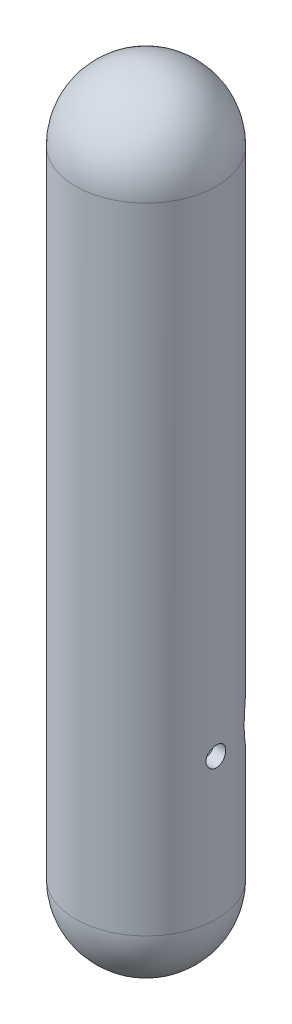
ISO-10303-21;
HEADER;
FILE_DESCRIPTION(('STEP AP214'),'2;1');
FILE_NAME('part.step','',(''),(''),'','','');
FILE_SCHEMA(('AUTOMOTIVE_DESIGN { 1 0 10303 214 1 1 1 1 }'));
ENDSEC;
DATA;
#1=APPLICATION_CONTEXT('core data for automotive mechanical design processes');
#2=APPLICATION_PROTOCOL_DEFINITION('international standard','automotive_design',2000,#1);
#3=PRODUCT_CONTEXT('',#1,'mechanical');
#4=PRODUCT('Part','Part','',(#3));
#5=PRODUCT_RELATED_PRODUCT_CATEGORY('part','',(#4));
#6=PRODUCT_DEFINITION_FORMATION('','',#4);
#7=PRODUCT_DEFINITION_CONTEXT('part definition',#1,'design');
#8=PRODUCT_DEFINITION('design','',#6,#7);
#9=PRODUCT_DEFINITION_SHAPE('','',#8);
#10=(LENGTH_UNIT() NAMED_UNIT(*) SI_UNIT(.MILLI.,.METRE.));
#11=(NAMED_UNIT(*) PLANE_ANGLE_UNIT() SI_UNIT($,.RADIAN.));
#12=(NAMED_UNIT(*) SI_UNIT($,.STERADIAN.) SOLID_ANGLE_UNIT());
#13=UNCERTAINTY_MEASURE_WITH_UNIT(LENGTH_MEASURE(1.E-05),#10,'distance_accuracy_value','');
#14=(GEOMETRIC_REPRESENTATION_CONTEXT(3) GLOBAL_UNCERTAINTY_ASSIGNED_CONTEXT((#13)) GLOBAL_UNIT_ASSIGNED_CONTEXT((#10,
#11,#12)) REPRESENTATION_CONTEXT('',''));
#15=CARTESIAN_POINT('',(0.,0.,0.));
#16=DIRECTION('',(0.,0.,1.));
#17=DIRECTION('',(1.,0.,0.));
#18=AXIS2_PLACEMENT_3D('',#15,#16,#17);
#19=CARTESIAN_POINT('',(0.,0.,0.));
#20=DIRECTION('',(0.,-1.,0.));
#21=DIRECTION('',(0.,0.,-1.));
#22=AXIS2_PLACEMENT_3D('',#19,#20,#21);
#23=CYLINDRICAL_SURFACE('',#22,9.99999999999999);
#24=CARTESIAN_POINT('',(0.,100.,0.));
#25=DIRECTION('',(0.,-1.,0.));
#26=DIRECTION('',(0.,0.,-1.));
#27=AXIS2_PLACEMENT_3D('',#24,#25,#26);
#28=CIRCLE('',#27,9.99999999999999);
#29=CARTESIAN_POINT('',(0.,100.,-9.99999999999999));
#30=VERTEX_POINT('',#29);
#31=EDGE_CURVE('E10',#30,#30,#28,.T.);
#32=ORIENTED_EDGE('',*,*,#31,.T.);
#33=EDGE_LOOP('',(#32));
#34=FACE_BOUND('',#33,.T.);
#35=CARTESIAN_POINT('',(0.,10.,0.));
#36=DIRECTION('',(0.,-1.,0.));
#37=DIRECTION('',(0.,0.,-1.));
#38=AXIS2_PLACEMENT_3D('',#35,#36,#37);
#39=CIRCLE('',#38,9.99999999999999);
#40=CARTESIAN_POINT('',(0.,10.,-9.99999999999999));
#41=VERTEX_POINT('',#40);
#42=EDGE_CURVE('E45',#41,#41,#39,.F.);
#43=ORIENTED_EDGE('',*,*,#42,.T.);
#44=EDGE_LOOP('',(#43));
#45=FACE_BOUND('',#44,.T.);
#46=CARTESIAN_POINT('',(-10.,28.6,0.));
#47=CARTESIAN_POINT('',(-9.99999880704253,28.6000032697073,0.0782282971881735));
#48=CARTESIAN_POINT('',(-9.99907239830974,28.6065789100539,0.156503461724666));
#49=CARTESIAN_POINT('',(-9.99546590789259,28.6327034180168,0.310870001631006));
#50=CARTESIAN_POINT('',(-9.99278406658852,28.6522653031329,0.386959105753096));
#51=CARTESIAN_POINT('',(-9.98596840414154,28.7037698158775,0.534696857228105));
#52=CARTESIAN_POINT('',(-9.98183563030519,28.7357035150471,0.606348663725388));
#53=CARTESIAN_POINT('',(-9.97257602428288,28.8110242859537,0.74326443539957));
#54=CARTESIAN_POINT('',(-9.96744934378478,28.8544096103338,0.808529373042031));
#55=CARTESIAN_POINT('',(-9.95673376484667,28.9517187998559,0.93127741814965));
#56=CARTESIAN_POINT('',(-9.95114223163037,29.005705486276,0.988710498897952));
#57=CARTESIAN_POINT('',(-9.94014802878933,29.1225498147466,1.09373320547752));
#58=CARTESIAN_POINT('',(-9.93474536950015,29.1854079413144,1.1413222933247));
#59=CARTESIAN_POINT('',(-9.92471494953013,29.3185425340003,1.22549749849271));
#60=CARTESIAN_POINT('',(-9.92009059124432,29.388849489033,1.26203583392651));
#61=CARTESIAN_POINT('',(-9.91217589223061,29.5346776298272,1.32276708626735));
#62=CARTESIAN_POINT('',(-9.90888548820392,29.6101985679758,1.34696058897522));
#63=CARTESIAN_POINT('',(-9.90403689130404,29.763787443895,1.38216138600053));
#64=CARTESIAN_POINT('',(-9.90246751199675,29.8418354972567,1.39325387196612));
#65=CARTESIAN_POINT('',(-9.90120459692899,29.99869982534,1.40220155009302));
#66=CARTESIAN_POINT('',(-9.90151096712262,30.0775160613487,1.40005740590941));
#67=CARTESIAN_POINT('',(-9.90395470049608,30.2330810770335,1.38266243777218));
#68=CARTESIAN_POINT('',(-9.90607887001525,30.309840653832,1.36750605461999));
#69=CARTESIAN_POINT('',(-9.9118982681395,30.4597162568869,1.32466447511777));
#70=CARTESIAN_POINT('',(-9.91559353591331,30.5328321922536,1.29697896640555));
#71=CARTESIAN_POINT('',(-9.92415350790331,30.6736349075709,1.22976542329452));
#72=CARTESIAN_POINT('',(-9.92902219396419,30.7413021319406,1.19019695060767));
#73=CARTESIAN_POINT('',(-9.93937746928839,30.8690721025225,1.10036953501586));
#74=CARTESIAN_POINT('',(-9.94486409393342,30.929174415168,1.05010997981794));
#75=CARTESIAN_POINT('',(-9.95589549462251,31.0406561740773,0.939806577010354));
#76=CARTESIAN_POINT('',(-9.96144036144259,31.0919552193111,0.879681443997922));
#77=CARTESIAN_POINT('',(-9.9719190380237,31.1837461991292,0.751631847221718));
#78=CARTESIAN_POINT('',(-9.97685284569486,31.2242380967523,0.683707356784826));
#79=CARTESIAN_POINT('',(-9.98555772534512,31.2932677746088,0.541920722447897));
#80=CARTESIAN_POINT('',(-9.98932824168404,31.3217998446175,0.468055762281818));
#81=CARTESIAN_POINT('',(-9.99527691675256,31.3660326161653,0.316518429788044));
#82=CARTESIAN_POINT('',(-9.99745516914293,31.381734072438,0.23884628169504));
#83=CARTESIAN_POINT('',(-9.99996158118379,31.3997541395857,0.0825938477894396));
#84=CARTESIAN_POINT('',(-10.0003050337974,31.4021833776036,0.00402655624313884));
#85=CARTESIAN_POINT('',(-9.99914463509871,31.3938829768854,-0.152394144717356));
#86=CARTESIAN_POINT('',(-9.99764083341114,31.38315369164,-0.230247573252169));
#87=CARTESIAN_POINT('',(-9.99296437014804,31.3489327707422,-0.38269913221073));
#88=CARTESIAN_POINT('',(-9.98979869497049,31.3254945490906,-0.4573094851513));
#89=CARTESIAN_POINT('',(-9.98215251897454,31.2665770723421,-0.601541169765909));
#90=CARTESIAN_POINT('',(-9.97767196343472,31.2310973161026,-0.671162293653039));
#91=CARTESIAN_POINT('',(-9.96785651297203,31.1488409592904,-0.803928908116773));
#92=CARTESIAN_POINT('',(-9.96251634013148,31.1019935982915,-0.86703016146962));
#93=CARTESIAN_POINT('',(-9.95159382460352,30.9984310372958,-0.984514153494663));
#94=CARTESIAN_POINT('',(-9.94601146975189,30.9417153412051,-1.0388964535897));
#95=CARTESIAN_POINT('',(-9.93518580711721,30.8195357041412,-1.13779715487911));
#96=CARTESIAN_POINT('',(-9.92994522900697,30.7540117321218,-1.18224173853561));
#97=CARTESIAN_POINT('',(-9.92044339319113,30.616363561707,-1.25949361855925));
#98=CARTESIAN_POINT('',(-9.91618211179366,30.5442395230443,-1.29230119646798));
#99=CARTESIAN_POINT('',(-9.90914065473312,30.3956662630285,-1.345231206824));
#100=CARTESIAN_POINT('',(-9.90635581183085,30.319231526468,-1.36539364982935));
#101=CARTESIAN_POINT('',(-9.90256973520277,30.1640192515939,-1.39258907049338));
#102=CARTESIAN_POINT('',(-9.90156839544136,30.085241852843,-1.3996228287002));
#103=CARTESIAN_POINT('',(-9.90146630506883,29.9283155852931,-1.40034443203664));
#104=CARTESIAN_POINT('',(-9.90234903246054,29.8501672357292,-1.3941482942421));
#105=CARTESIAN_POINT('',(-9.90587987183737,29.6960351066924,-1.3688333716359));
#106=CARTESIAN_POINT('',(-9.90852798237267,29.620051325442,-1.34971459743688));
#107=CARTESIAN_POINT('',(-9.91528571653348,29.4724303196629,-1.29913617920526));
#108=CARTESIAN_POINT('',(-9.91939450417524,29.4007906362896,-1.26768359307711));
#109=CARTESIAN_POINT('',(-9.92861179338547,29.2637865918143,-1.19334180710318));
#110=CARTESIAN_POINT('',(-9.93372031992192,29.1984223875001,-1.15045232161689));
#111=CARTESIAN_POINT('',(-9.944414980861,29.0752336694378,-1.05402880045864));
#112=CARTESIAN_POINT('',(-9.95000475889879,29.0174769289973,-1.00040857472563));
#113=CARTESIAN_POINT('',(-9.96100092698613,28.9117388169935,-0.884227351219558));
#114=CARTESIAN_POINT('',(-9.96640727387545,28.8637597329393,-0.821664267052116));
#115=CARTESIAN_POINT('',(-9.97645654561439,28.7787378990445,-0.689025225519359));
#116=CARTESIAN_POINT('',(-9.98109570676177,28.7417483955641,-0.618914862292061));
#117=CARTESIAN_POINT('',(-9.98905061891875,28.6801235543674,-0.473447613388805));
#118=CARTESIAN_POINT('',(-9.99236776836323,28.655475155015,-0.39809637122268));
#119=CARTESIAN_POINT('',(-9.99652970400106,28.6249547773688,-0.268653720963262));
#120=CARTESIAN_POINT('',(-9.99782452761313,28.6156106733124,-0.215369033513962));
#121=CARTESIAN_POINT('',(-9.99956008335211,28.6031321866934,-0.108063681641057));
#122=CARTESIAN_POINT('',(-10.0000008241395,28.5999977411643,-0.0540430246858417));
#123=CARTESIAN_POINT('',(-10.,28.6,0.));
#124=B_SPLINE_CURVE_WITH_KNOTS('',3,(#46,#47,#48,#49,#50,#51,#52,#53,#54,#55,#56,#57,#58,#59,
#60,#61,#62,#63,#64,#65,#66,#67,#68,#69,#70,#71,#72,#73,#74,#75,#76,#77,#78,#79,#80,#81,#82,#83,
#84,#85,#86,#87,#88,#89,#90,#91,#92,#93,#94,#95,#96,#97,#98,#99,#100,#101,#102,#103,#104,#105,
#106,#107,#108,#109,#110,#111,#112,#113,#114,#115,#116,#117,#118,#119,#120,#121,#122,#123),
.UNSPECIFIED.,.T.,.F.,(4,2,2,2,2,2,2,2,2,2,2,2,2,2,2,2,2,2,2,2,2,2,2,2,2,2,2,2,2,2,2,2,2,2,2,2,
2,2,4),(0.,0.234487445699966,0.469210298847026,0.703764072406696,0.938282077027581,
1.17423416905446,1.41019915269479,1.64717029041254,1.88413018206406,2.11954056518414,
2.35493914544915,2.58864354479997,2.82235377092958,3.05686851420482,3.29139669207854,
3.52796437553467,3.76453286805564,4.00121418200078,4.23788157266708,4.4725732392471,
4.70725860120585,4.94096517128053,5.1746814689058,5.40989169440529,5.64511374764216,
5.88202891996441,6.11893836005413,6.35509436054733,6.59123632025849,6.82531598707862,
7.05939546166267,7.29334118154644,7.52729274485311,7.76320483684767,7.99917205791181,
8.23626460203056,8.47310567775886,8.63509999149645,8.79709266258835),.UNSPECIFIED.);
#125=CARTESIAN_POINT('',(-10.,28.6,0.));
#126=VERTEX_POINT('',#125);
#127=EDGE_CURVE('E95',#126,#126,#124,.T.);
#128=ORIENTED_EDGE('',*,*,#127,.F.);
#129=EDGE_LOOP('',(#128));
#130=FACE_BOUND('',#129,.T.);
#131=CARTESIAN_POINT('',(9.90151503558925,30.,-1.4));
#132=CARTESIAN_POINT('',(9.9015162730607,30.0782240619009,-1.39999672662405));
#133=CARTESIAN_POINT('',(9.90245203756476,30.1564950029748,-1.39342177423909));
#134=CARTESIAN_POINT('',(9.9060919263217,30.310852769077,-1.36730024696761));
#135=CARTESIAN_POINT('',(9.90879782721155,30.3869373195087,-1.34774063944957));
#136=CARTESIAN_POINT('',(9.91566563693761,30.5346654373276,-1.29624278801192));
#137=CARTESIAN_POINT('',(9.91982648268597,30.6063122024095,-1.26431358038298));
#138=CARTESIAN_POINT('',(9.92913409071496,30.7432195094394,-1.18900339025604));
#139=CARTESIAN_POINT('',(9.93428070346084,30.8084810177258,-1.14562414428123));
#140=CARTESIAN_POINT('',(9.94502019376564,30.9312328634136,-1.04832112500601));
#141=CARTESIAN_POINT('',(9.95061565841439,30.9886721047782,-0.994333169772057));
#142=CARTESIAN_POINT('',(9.96159922546732,31.093706722025,-0.87748370741462));
#143=CARTESIAN_POINT('',(9.96698731692517,31.1413015788435,-0.814621732685797));
#144=CARTESIAN_POINT('',(9.97697589409725,31.2254828738298,-0.681483697113108));
#145=CARTESIAN_POINT('',(9.98157300141575,31.2620225739707,-0.611177809429792));
#146=CARTESIAN_POINT('',(9.98943307242256,31.3227566428064,-0.465351986064068));
#147=CARTESIAN_POINT('',(9.99269609772691,31.3469515816706,-0.389832291375442));
#148=CARTESIAN_POINT('',(9.99750210964364,31.3821552954104,-0.236247513331733));
#149=CARTESIAN_POINT('',(9.99905622439132,31.3932494160138,-0.15820234620508));
#150=CARTESIAN_POINT('',(10.0003073920407,31.4022013637561,-0.00134369084847308));
#151=CARTESIAN_POINT('',(10.0000045354807,31.4000598362116,0.0774697597360318));
#152=CARTESIAN_POINT('',(9.99758482232096,31.3826690685239,0.233046160023505));
#153=CARTESIAN_POINT('',(9.99548067103802,31.3675116329436,0.309819597453309));
#154=CARTESIAN_POINT('',(9.98970897409181,31.3246631665315,0.459722376120686));
#155=CARTESIAN_POINT('',(9.98604139249791,31.2969718476459,0.532851633564829));
#156=CARTESIAN_POINT('',(9.97753303441477,31.2297461572451,0.673670721318747));
#157=CARTESIAN_POINT('',(9.97268839463014,31.1901726835853,0.741341641724476));
#158=CARTESIAN_POINT('',(9.96236674208744,31.1003345312268,0.869116895146091));
#159=CARTESIAN_POINT('',(9.95688969301369,31.0500692384179,0.929220793216091));
#160=CARTESIAN_POINT('',(9.94585954014101,30.9397616926621,1.04069628788961));
#161=CARTESIAN_POINT('',(9.94030618681269,30.8796393437514,1.09198863528123));
#162=CARTESIAN_POINT('',(9.9297953326518,30.7515977294033,1.18376741736725));
#163=CARTESIAN_POINT('',(9.92483783465006,30.6836784269267,1.22425380072513));
#164=CARTESIAN_POINT('',(9.91608014267364,30.5418933484411,1.29327948111305));
#165=CARTESIAN_POINT('',(9.91228066456383,30.468023929712,1.32181139219249));
#166=CARTESIAN_POINT('',(9.90628238974168,30.3164768838692,1.36604248657344));
#167=CARTESIAN_POINT('',(9.9040834953991,30.2387994893377,1.38174245258774));
#168=CARTESIAN_POINT('',(9.90155361688982,30.0825443790757,1.39975688402148));
#169=CARTESIAN_POINT('',(9.90120700434131,30.00397981929,1.40218334699348));
#170=CARTESIAN_POINT('',(9.90237951129801,29.8475652427712,1.39387837110511));
#171=CARTESIAN_POINT('',(9.90389858060215,29.7697152068687,1.3831472862832));
#172=CARTESIAN_POINT('',(9.90861697602896,29.6172817335727,1.34892653360383));
#173=CARTESIAN_POINT('',(9.91180903893251,29.5426856738765,1.32549200216921));
#174=CARTESIAN_POINT('',(9.9195078141658,29.3984809488866,1.26658667705874));
#175=CARTESIAN_POINT('',(9.92401458363683,29.328872500534,1.23111536021524));
#176=CARTESIAN_POINT('',(9.93387205811627,29.1961149060344,1.14887163817769));
#177=CARTESIAN_POINT('',(9.93922812639451,29.1330113257238,1.10202633440552));
#178=CARTESIAN_POINT('',(9.95016427300038,29.015521684502,0.998466461543069));
#179=CARTESIAN_POINT('',(9.95574436230646,28.961136051479,0.941751408317562));
#180=CARTESIAN_POINT('',(9.96654831644373,28.8622275987041,0.819570399745713));
#181=CARTESIAN_POINT('',(9.97176932192274,28.8177787389132,0.754044282367005));
#182=CARTESIAN_POINT('',(9.98122313930671,28.7405193637223,0.616390628320449));
#183=CARTESIAN_POINT('',(9.98545597533704,28.7077085641782,0.544263252876917));
#184=CARTESIAN_POINT('',(9.99244393583437,28.6547765374091,0.395691655713115));
#185=CARTESIAN_POINT('',(9.99520387749127,28.6346139051488,0.319262421544564));
#186=CARTESIAN_POINT('',(9.99895521214527,28.607416243492,0.164061795812));
#187=CARTESIAN_POINT('',(9.99994670627057,28.6003804634388,0.0852905384378635));
#188=CARTESIAN_POINT('',(10.0000486453508,28.599652737662,-0.0716387766005749));
#189=CARTESIAN_POINT('',(9.99917509410872,28.6058472639228,-0.149796321377755));
#190=CARTESIAN_POINT('',(9.99567716257506,28.6311621884341,-0.303947255586206));
#191=CARTESIAN_POINT('',(9.99305278588063,28.6502825601283,-0.379940649463429));
#192=CARTESIAN_POINT('',(9.98634668245478,28.7008680443135,-0.52758173646429));
#193=CARTESIAN_POINT('',(9.98226576487009,28.7323263037412,-0.599231816611352));
#194=CARTESIAN_POINT('',(9.97309634224917,28.806682671579,-0.736254303299752));
#195=CARTESIAN_POINT('',(9.96800781309464,28.8495810538294,-0.801626559518837));
#196=CARTESIAN_POINT('',(9.95733781361616,28.9460146289401,-0.924815450464117));
#197=CARTESIAN_POINT('',(9.95175265152416,28.9996339603557,-0.982565906097607));
#198=CARTESIAN_POINT('',(9.94074715508525,29.1158107732826,-1.08829175391991));
#199=CARTESIAN_POINT('',(9.93532685984937,29.1783703559205,-1.1362648417956));
#200=CARTESIAN_POINT('',(9.92523664859479,29.3110062837696,-1.22127990372749));
#201=CARTESIAN_POINT('',(9.92057050635006,29.3811176734009,-1.25826763499522));
#202=CARTESIAN_POINT('',(9.91256109215701,29.526587040073,-1.31988888235082));
#203=CARTESIAN_POINT('',(9.90921642025511,29.6019393648155,-1.34453547996553));
#204=CARTESIAN_POINT('',(9.90501810390983,29.7313772451973,-1.37505100954109));
#205=CARTESIAN_POINT('',(9.90371123781126,29.7846557420768,-1.38439293421899));
#206=CARTESIAN_POINT('',(9.9019592807621,29.8919487075781,-1.39686852742366));
#207=CARTESIAN_POINT('',(9.90151418074951,29.9459631684547,-1.40000226123344));
#208=CARTESIAN_POINT('',(9.90151503558925,30.,-1.4));
#209=B_SPLINE_CURVE_WITH_KNOTS('',3,(#131,#132,#133,#134,#135,#136,#137,#138,#139,#140,#141,
#142,#143,#144,#145,#146,#147,#148,#149,#150,#151,#152,#153,#154,#155,#156,#157,#158,#159,#160,
#161,#162,#163,#164,#165,#166,#167,#168,#169,#170,#171,#172,#173,#174,#175,#176,#177,#178,#179,
#180,#181,#182,#183,#184,#185,#186,#187,#188,#189,#190,#191,#192,#193,#194,#195,#196,#197,#198,
#199,#200,#201,#202,#203,#204,#205,#206,#207,#208),.UNSPECIFIED.,.T.,.F.,(4,2,2,2,2,2,2,2,2,2,2,
2,2,2,2,2,2,2,2,2,2,2,2,2,2,2,2,2,2,2,2,2,2,2,2,2,2,2,4),(0.,0.234474721077553,
0.469185139765228,0.703724419183187,0.93822814857916,1.17419689654789,1.4101780832387,
1.64714342111303,1.88409781324488,2.11949988938907,2.3548904883726,2.5886343271484,
2.82238353809807,3.05691056944184,3.29145107504761,3.52800157028831,3.76455318930293,
4.00125074460862,4.23793386094717,4.47261680490461,4.70729343423817,4.94095956440578,
5.17463585195517,5.40985130824279,5.64507830567474,5.88200177335286,6.1189194561282,
6.35505746149814,6.59118196294743,6.82528844692471,7.05939444992751,7.29337060280254,
7.5273523568313,7.76324807874158,7.99919933202215,8.2362969868904,8.47314278481745,
8.63511857506059,8.79709266201813),.UNSPECIFIED.);
#210=CARTESIAN_POINT('',(9.90151503558925,30.,-1.4));
#211=VERTEX_POINT('',#210);
#212=EDGE_CURVE('E67',#211,#211,#209,.T.);
#213=ORIENTED_EDGE('',*,*,#212,.F.);
#214=EDGE_LOOP('',(#213));
#215=FACE_BOUND('',#214,.T.);
#216=CARTESIAN_POINT('',(8.2,30.,-5.72363520850166));
#217=CARTESIAN_POINT('',(8.19999845029204,30.148665762051,-5.72363918078505));
#218=CARTESIAN_POINT('',(8.19594577426921,30.2973774358285,-5.72945715757752));
#219=CARTESIAN_POINT('',(8.17983700049565,30.5935426209408,-5.75243025553921));
#220=CARTESIAN_POINT('',(8.16777568942388,30.7409952493142,-5.76959276153868));
#221=CARTESIAN_POINT('',(8.13590503590753,31.0338272661081,-5.81444775906725));
#222=CARTESIAN_POINT('',(8.11607525630121,31.1792001288278,-5.84216802037736));
#223=CARTESIAN_POINT('',(8.06908357823666,31.4666709025321,-5.90690145400924));
#224=CARTESIAN_POINT('',(8.04191893088562,31.6087675639786,-5.94391810998216));
#225=CARTESIAN_POINT('',(7.96934368149641,31.9412051535505,-6.04106518159058));
#226=CARTESIAN_POINT('',(7.92090337480695,32.1298692136769,-6.104674483853));
#227=CARTESIAN_POINT('',(7.81216303913739,32.4994526865397,-6.24322498158211));
#228=CARTESIAN_POINT('',(7.75185721804756,32.6803682641512,-6.31817170722585));
#229=CARTESIAN_POINT('',(7.62008324646701,33.0348260953108,-6.47649305612632));
#230=CARTESIAN_POINT('',(7.54858771305322,33.2083488960556,-6.5598881724553));
#231=CARTESIAN_POINT('',(7.39516058803913,33.547714063633,-6.73237975748579));
#232=CARTESIAN_POINT('',(7.31322938295879,33.7135567146156,-6.8214760149657));
#233=CARTESIAN_POINT('',(7.10372295681397,34.1041906633319,-7.04049024360612));
#234=CARTESIAN_POINT('',(6.97118887450937,34.3253352563698,-7.17219417558071));
#235=CARTESIAN_POINT('',(6.68673774600413,34.7532681849656,-7.43811179415109));
#236=CARTESIAN_POINT('',(6.53481295726375,34.9600507346763,-7.57232646489315));
#237=CARTESIAN_POINT('',(6.21197106613259,35.3588395705311,-7.83934109820667));
#238=CARTESIAN_POINT('',(6.04107068866567,35.5508586203515,-7.97214219529734));
#239=CARTESIAN_POINT('',(5.68028657505754,35.9195286408201,-8.23309720151584));
#240=CARTESIAN_POINT('',(5.49040971082113,36.096185131643,-8.36125277017147));
#241=CARTESIAN_POINT('',(5.13288958935701,36.3981499879349,-8.58418462068379));
#242=CARTESIAN_POINT('',(4.96873286377669,36.5265360092601,-8.68039548894352));
#243=CARTESIAN_POINT('',(4.62869958686473,36.7719334651253,-8.86637886879759));
#244=CARTESIAN_POINT('',(4.45282538920854,36.8889471724679,-8.9561526659221));
#245=CARTESIAN_POINT('',(4.08989778496485,37.1104056998991,-9.12759365181682));
#246=CARTESIAN_POINT('',(3.90285821517697,37.2148656125527,-9.20927055380472));
#247=CARTESIAN_POINT('',(3.51801120883839,37.4101368490058,-9.36303939947025));
#248=CARTESIAN_POINT('',(3.32020566595918,37.5009505625908,-9.43513302116051));
#249=CARTESIAN_POINT('',(2.94890351804072,37.653574426263,-9.55695887569961));
#250=CARTESIAN_POINT('',(2.77691835311688,37.7176935945165,-9.60841249476367));
#251=CARTESIAN_POINT('',(2.42692048404364,37.8348001400111,-9.70272577730947));
#252=CARTESIAN_POINT('',(2.24890897858629,37.8877897160942,-9.74558713826288));
#253=CARTESIAN_POINT('',(1.88785962057538,37.9819029583093,-9.82191514427454));
#254=CARTESIAN_POINT('',(1.70482350524437,38.0230306703892,-9.85538499256584));
#255=CARTESIAN_POINT('',(1.33483690462268,38.0928144701131,-9.9122770996661));
#256=CARTESIAN_POINT('',(1.14788637363197,38.1214704120665,-9.93569924110141));
#257=CARTESIAN_POINT('',(0.770689433061854,38.1659194158599,-9.97206475692019));
#258=CARTESIAN_POINT('',(0.580432934570033,38.1816613150669,-9.98496645037282));
#259=CARTESIAN_POINT('',(0.198855132493043,38.1998132860956,-9.99984553544618));
#260=CARTESIAN_POINT('',(0.00753382674624958,38.2022233308428,-10.0018229048817));
#261=CARTESIAN_POINT('',(-0.374603455109708,38.1936682243243,-9.99480830863374));
#262=CARTESIAN_POINT('',(-0.565419435891518,38.1827031971712,-9.98581644473805));
#263=CARTESIAN_POINT('',(-0.945006568531927,38.1475942062816,-9.95706733081528));
#264=CARTESIAN_POINT('',(-1.13377778068408,38.1234506322222,-9.93731039910108));
#265=CARTESIAN_POINT('',(-1.49619005497699,38.0643042232307,-9.88902072547037));
#266=CARTESIAN_POINT('',(-1.67004129850786,38.03007121691,-9.8611110654101));
#267=CARTESIAN_POINT('',(-2.01370941272638,37.9508543102179,-9.7967113140896));
#268=CARTESIAN_POINT('',(-2.18352489764754,37.9058667740463,-9.76021832111627));
#269=CARTESIAN_POINT('',(-2.51814583097657,37.8057306102103,-9.67928507699062));
#270=CARTESIAN_POINT('',(-2.68295229691842,37.750584062542,-9.6348464527129));
#271=CARTESIAN_POINT('',(-3.00690912006695,37.6307512852589,-9.53871547738333));
#272=CARTESIAN_POINT('',(-3.16605737342775,37.5660615523792,-9.48702046287921));
#273=CARTESIAN_POINT('',(-3.66216062085537,37.3462076995345,-9.31226817848175));
#274=CARTESIAN_POINT('',(-3.98756560659057,37.1742835763739,-9.17692316169504));
#275=CARTESIAN_POINT('',(-4.60502970972162,36.7945140104772,-8.88317943960757));
#276=CARTESIAN_POINT('',(-4.8970736556371,36.5866523316992,-8.72477031942385));
#277=CARTESIAN_POINT('',(-5.33768355929078,36.2285499278536,-8.45853117444757));
#278=CARTESIAN_POINT('',(-5.49728215530601,36.0880720860728,-8.35550223675767));
#279=CARTESIAN_POINT('',(-5.80380820977519,35.796596885393,-8.14556913954089));
#280=CARTESIAN_POINT('',(-5.95073709351314,35.6456007132216,-8.03866541783608));
#281=CARTESIAN_POINT('',(-6.23209205159304,35.3334099048705,-7.8225663787245));
#282=CARTESIAN_POINT('',(-6.36649862257202,35.1721999958689,-7.71336780085986));
#283=CARTESIAN_POINT('',(-6.62249725825448,34.840091750198,-7.49472169166754));
#284=CARTESIAN_POINT('',(-6.74409041160472,34.6691942385021,-7.3852741822979));
#285=CARTESIAN_POINT('',(-6.9705234312532,34.3235481249576,-7.17183386357506));
#286=CARTESIAN_POINT('',(-7.07578377829368,34.1491127809911,-7.0677802450031));
#287=CARTESIAN_POINT('',(-7.27392836391071,33.7910233289918,-6.86368634859728));
#288=CARTESIAN_POINT('',(-7.36681024054985,33.607367470769,-6.76364683923399));
#289=CARTESIAN_POINT('',(-7.53951725209473,33.2308633595459,-6.57057232626014));
#290=CARTESIAN_POINT('',(-7.61936417791937,33.0380311587665,-6.47752577582952));
#291=CARTESIAN_POINT('',(-7.76530584744956,32.6428075262286,-6.30182977288097));
#292=CARTESIAN_POINT('',(-7.83140852984093,32.4404216960158,-6.21917432942152));
#293=CARTESIAN_POINT('',(-7.96574307672426,31.9656864674008,-6.04666373879948));
#294=CARTESIAN_POINT('',(-8.02905430473027,31.6900406425203,-5.9616482226471));
#295=CARTESIAN_POINT('',(-8.10279916928975,31.2669462389715,-5.86057865164011));
#296=CARTESIAN_POINT('',(-8.12383678099295,31.1244093320701,-5.83130853128246));
#297=CARTESIAN_POINT('',(-8.15847661563742,30.8367817570627,-5.78274633689972));
#298=CARTESIAN_POINT('',(-8.17208262620266,30.6916924288302,-5.76344918027851));
#299=CARTESIAN_POINT('',(-8.19162995420366,30.3986800808942,-5.73563385725068));
#300=CARTESIAN_POINT('',(-8.19750359999598,30.2507433914952,-5.72721087095085));
#301=CARTESIAN_POINT('',(-8.20121126023309,29.9545635327531,-5.72190049104242));
#302=CARTESIAN_POINT('',(-8.19904557586369,29.8063203750995,-5.72501266528006));
#303=CARTESIAN_POINT('',(-8.18672742595899,29.5107131850006,-5.74261320614224));
#304=CARTESIAN_POINT('',(-8.17656733231114,29.3633501277163,-5.75711243805458));
#305=CARTESIAN_POINT('',(-8.14851040064312,29.0708155843643,-5.79675431833161));
#306=CARTESIAN_POINT('',(-8.13061236354988,28.9256444415657,-5.82189861624505));
#307=CARTESIAN_POINT('',(-8.08316673959903,28.609765571531,-5.88764537347011));
#308=CARTESIAN_POINT('',(-8.05200830875128,28.4397347258226,-5.93032990957375));
#309=CARTESIAN_POINT('',(-7.97986943692603,28.1049945167048,-6.02704839620459));
#310=CARTESIAN_POINT('',(-7.93888114032976,27.9402895295772,-6.08109141966935));
#311=CARTESIAN_POINT('',(-7.84770493010685,27.6163220736771,-6.19831004129041));
#312=CARTESIAN_POINT('',(-7.79749400826159,27.4570744256303,-6.26150839455208));
#313=CARTESIAN_POINT('',(-7.6885631892845,27.1445894901903,-6.39479566653529));
#314=CARTESIAN_POINT('',(-7.62984549790546,26.9913506577964,-6.46488279752905));
#315=CARTESIAN_POINT('',(-7.4705216294889,26.6096929739007,-6.6492907166511));
#316=CARTESIAN_POINT('',(-7.3643916605386,26.3852517601655,-6.76709842291279));
#317=CARTESIAN_POINT('',(-7.13409045852319,25.9496313940426,-7.00947648876531));
#318=CARTESIAN_POINT('',(-7.00991023694235,25.738458924597,-7.1340501981621));
#319=CARTESIAN_POINT('',(-6.74391029336172,25.3288807290219,-7.38601939138507));
#320=CARTESIAN_POINT('',(-6.60206986117162,25.1304904140651,-7.51341804142734));
#321=CARTESIAN_POINT('',(-6.30112210515737,24.7468796368465,-7.76753863947033));
#322=CARTESIAN_POINT('',(-6.14201792196774,24.5616567892634,-7.89426070616926));
#323=CARTESIAN_POINT('',(-5.80197167767219,24.1999644419872,-8.14759535233519));
#324=CARTESIAN_POINT('',(-5.62054929928228,24.0238758762554,-8.27410903422021));
#325=CARTESIAN_POINT('',(-5.23956571229622,23.6871899986419,-8.52047050623372));
#326=CARTESIAN_POINT('',(-5.04000146532249,23.52659529097,-8.64031717434122));
#327=CARTESIAN_POINT('',(-4.62356552958158,23.222915156342,-8.87012180565673));
#328=CARTESIAN_POINT('',(-4.40673964271624,23.0797857879024,-8.9801043931196));
#329=CARTESIAN_POINT('',(-3.95603948036187,22.8126302439298,-9.18755713537746));
#330=CARTESIAN_POINT('',(-3.7221741951779,22.6885941004604,-9.28503381463301));
#331=CARTESIAN_POINT('',(-3.31403012536037,22.4972665509396,-9.43656465874623));
#332=CARTESIAN_POINT('',(-3.14388033036262,22.424334119294,-9.49468701555593));
#333=CARTESIAN_POINT('',(-2.79676286783762,22.2894381445103,-9.60266249699226));
#334=CARTESIAN_POINT('',(-2.61979699971864,22.2274717302416,-9.65251778589265));
#335=CARTESIAN_POINT('',(-2.25997043490155,22.1153296121794,-9.74304536139851));
#336=CARTESIAN_POINT('',(-2.07711279329173,22.0651479060351,-9.78372232242157));
#337=CARTESIAN_POINT('',(-1.70649420082205,21.9772733893539,-9.85512484623503));
#338=CARTESIAN_POINT('',(-1.51873310608263,21.9395809457284,-9.88585011666264));
#339=CARTESIAN_POINT('',(-1.13864165623842,21.8771449630754,-9.93682276810786));
#340=CARTESIAN_POINT('',(-0.94629272109878,21.852469253626,-9.95701525732996));
#341=CARTESIAN_POINT('',(-0.55948071081461,21.8168036844277,-9.98622034704965));
#342=CARTESIAN_POINT('',(-0.36501764128004,21.8058137883717,-9.99523297720626));
#343=CARTESIAN_POINT('',(0.0243750728627505,21.7977243176192,-10.0018658784345));
#344=CARTESIAN_POINT('',(0.2193046755462,21.8006235384103,-9.99948713740536));
#345=CARTESIAN_POINT('',(0.607986349465818,21.820255924752,-9.98339527630784));
#346=CARTESIAN_POINT('',(0.801738475897268,21.8369884367362,-9.96968269171707));
#347=CARTESIAN_POINT('',(1.17134681345671,21.8821281616239,-9.932758436589));
#348=CARTESIAN_POINT('',(1.34741286398967,21.9095146132584,-9.91037791201712));
#349=CARTESIAN_POINT('',(1.69613104159484,21.9753732090925,-9.85668662721532));
#350=CARTESIAN_POINT('',(1.86878200334525,22.0138490698744,-9.82537287307619));
#351=CARTESIAN_POINT('',(2.20956236017167,22.1013434947688,-9.75438982355915));
#352=CARTESIAN_POINT('',(2.3776931786531,22.1503586952096,-9.71472319411752));
#353=CARTESIAN_POINT('',(2.70872885229022,22.2583517194881,-9.62767352742328));
#354=CARTESIAN_POINT('',(2.87163172402805,22.3173332724876,-9.58028760204098));
#355=CARTESIAN_POINT('',(3.20192562653266,22.4487563316724,-9.47521079852595));
#356=CARTESIAN_POINT('',(3.36891788997763,22.5218243107101,-9.41704975099366));
#357=CARTESIAN_POINT('',(3.69560469836566,22.6777527012273,-9.29370973744541));
#358=CARTESIAN_POINT('',(3.85529632474856,22.7606169822965,-9.22852799913047));
#359=CARTESIAN_POINT('',(4.32283848009589,23.0228452842332,-9.02378342373984));
#360=CARTESIAN_POINT('',(4.61919600743849,23.2158608231756,-8.87500823961635));
#361=CARTESIAN_POINT('',(5.10353234962039,23.5766699236518,-8.60285962342859));
#362=CARTESIAN_POINT('',(5.29923518151543,23.7373043183267,-8.48340271449987));
#363=CARTESIAN_POINT('',(5.6729323236676,24.0737030965517,-8.23818633198212));
#364=CARTESIAN_POINT('',(5.8509264888482,24.2494676040318,-8.1124268067722));
#365=CARTESIAN_POINT('',(6.18941735205611,24.6154472766337,-7.85723569681623));
#366=CARTESIAN_POINT('',(6.34987655403885,24.8056919877683,-7.72779696113332));
#367=CARTESIAN_POINT('',(6.65277023285172,25.1997506662167,-7.46862289954924));
#368=CARTESIAN_POINT('',(6.79520994283707,25.4035606675857,-7.33888767094893));
#369=CARTESIAN_POINT('',(7.03481062865707,25.7820711196131,-7.10867003475751));
#370=CARTESIAN_POINT('',(7.13529914921573,25.9543067016858,-7.00758478788669));
#371=CARTESIAN_POINT('',(7.32437736904772,26.3076215105363,-6.80971433300203));
#372=CARTESIAN_POINT('',(7.41296581116533,26.4887016689274,-6.71292958002536));
#373=CARTESIAN_POINT('',(7.57752729133723,26.8595980329599,-6.52659898507542));
#374=CARTESIAN_POINT('',(7.65352698346121,27.0493946653617,-6.43703806004051));
#375=CARTESIAN_POINT('',(7.79226451359239,27.4381172418374,-6.26837515841902));
#376=CARTESIAN_POINT('',(7.85500978268719,27.6370379939239,-6.18926733067377));
#377=CARTESIAN_POINT('',(7.98515389955688,28.1139294831425,-6.02098281179763));
#378=CARTESIAN_POINT('',(8.04682091415735,28.3956919451165,-5.93759740574258));
#379=CARTESIAN_POINT('',(8.11707638340582,28.8276720334397,-5.84077446054159));
#380=CARTESIAN_POINT('',(8.136776519009,28.9730330176743,-5.81322628765875));
#381=CARTESIAN_POINT('',(8.16842479092183,29.2661687779617,-5.768673826873));
#382=CARTESIAN_POINT('',(8.18037822798656,29.4139418324009,-5.75166232949922));
#383=CARTESIAN_POINT('',(8.19219976237523,29.6350585637473,-5.73479736922209));
#384=CARTESIAN_POINT('',(8.19512231674813,29.7079420536755,-5.73061795784842));
#385=CARTESIAN_POINT('',(8.19902298182958,29.8538799811246,-5.72503566510104));
#386=CARTESIAN_POINT('',(8.20000076164323,29.9269344456194,-5.72363325622238));
#387=CARTESIAN_POINT('',(8.2,30.,-5.72363520850166));
#388=B_SPLINE_CURVE_WITH_KNOTS('',3,(#216,#217,#218,#219,#220,#221,#222,#223,#224,#225,#226,
#227,#228,#229,#230,#231,#232,#233,#234,#235,#236,#237,#238,#239,#240,#241,#242,#243,#244,#245,
#246,#247,#248,#249,#250,#251,#252,#253,#254,#255,#256,#257,#258,#259,#260,#261,#262,#263,#264,
#265,#266,#267,#268,#269,#270,#271,#272,#273,#274,#275,#276,#277,#278,#279,#280,#281,#282,#283,
#284,#285,#286,#287,#288,#289,#290,#291,#292,#293,#294,#295,#296,#297,#298,#299,#300,#301,#302,
#303,#304,#305,#306,#307,#308,#309,#310,#311,#312,#313,#314,#315,#316,#317,#318,#319,#320,#321,
#322,#323,#324,#325,#326,#327,#328,#329,#330,#331,#332,#333,#334,#335,#336,#337,#338,#339,#340,
#341,#342,#343,#344,#345,#346,#347,#348,#349,#350,#351,#352,#353,#354,#355,#356,#357,#358,#359,
#360,#361,#362,#363,#364,#365,#366,#367,#368,#369,#370,#371,#372,#373,#374,#375,#376,#377,#378,
#379,#380,#381,#382,#383,#384,#385,#386,#387),.UNSPECIFIED.,.T.,.F.,(4,2,2,2,2,2,2,2,2,2,2,2,2,
2,2,2,2,2,2,2,2,2,2,2,2,2,2,2,2,2,2,2,2,2,2,2,2,2,2,2,2,2,2,2,2,2,2,2,2,2,2,2,2,2,2,2,2,2,2,2,2,
2,2,2,2,2,2,2,2,2,2,2,2,2,2,2,2,2,2,2,2,2,2,2,2,4),(0.,0.445912188655757,0.892114934370182,
1.33949951224124,1.78705198997576,2.40078065685194,3.01480965986869,3.63036548233387,
4.24589851225874,5.11329986478797,5.98104865301046,6.84803859667169,7.71471570940851,
8.40271749490045,9.09058149649745,9.77761007338951,10.464518194088,11.0358226987593,
11.6070142260278,12.1780106952828,12.7490138345288,13.3222683857384,13.8955241011153,
14.4687744970641,15.0420079434609,15.579545959132,16.1172659587387,16.6548759855463,
17.1926838602049,18.3644625044751,19.5367719305442,20.2450140095332,20.9531763103393,
21.6624237461401,22.3716108745723,23.0573918038777,23.7433034003448,24.4280563280523,
25.1124126364177,25.9948323832165,26.4354514868834,26.8758458125493,27.32006928222,
27.7642761096519,28.2089073055003,28.6536074261863,29.18693702208,29.7206942614168,
30.2558016423994,30.7907705208531,31.6139720986487,32.4375850209414,33.2621730584179,
34.0866113369322,34.9337278536077,35.7809865066012,36.6260675350404,37.4707058675102,
38.0522618254091,38.6336652939056,39.2147719885458,39.7958957535091,40.3800185373925,
40.964139771655,41.5482103498168,42.1322533346177,42.670400462682,43.2087281592885,
43.746884300837,44.2852422547807,44.8586654144747,45.4323158408729,46.5794835842282,
47.4183978552175,48.2573189983654,49.0980003313595,49.9384369535078,50.6086526260579,
51.2789390463723,51.9477876132588,52.6162601893001,53.5130780128973,53.9603645229448,
54.4073446487172,54.6264622098301,54.8456170496513),.UNSPECIFIED.);
#389=CARTESIAN_POINT('',(8.2,30.,-5.72363520850166));
#390=VERTEX_POINT('',#389);
#391=EDGE_CURVE('E55',#390,#390,#388,.T.);
#392=ORIENTED_EDGE('',*,*,#391,.T.);
#393=EDGE_LOOP('',(#392));
#394=FACE_BOUND('',#393,.T.);
#395=ADVANCED_FACE('F37',(#34,#45,#130,#215,#394),#23,.T.);
#396=CARTESIAN_POINT('',(0.,30.,5.));
#397=DIRECTION('',(0.,0.,-1.));
#398=DIRECTION('',(-1.,0.,0.));
#399=AXIS2_PLACEMENT_3D('',#396,#397,#398);
#400=CYLINDRICAL_SURFACE('',#399,8.2);
#401=CARTESIAN_POINT('',(-8.2,30.,1.4));
#402=CARTESIAN_POINT('',(-8.19999864515162,29.9219694005138,1.39999689665544));
#403=CARTESIAN_POINT('',(-8.19887461696222,29.8438969183318,1.39345427366856));
#404=CARTESIAN_POINT('',(-8.19449890224323,29.6899435731814,1.36746863869525));
#405=CARTESIAN_POINT('',(-8.191245289166,29.6140647596981,1.34801394546769));
#406=CARTESIAN_POINT('',(-8.18297515874335,29.4667482494848,1.29681029873297));
#407=CARTESIAN_POINT('',(-8.17796011194915,29.3953069064579,1.2650715984102));
#408=CARTESIAN_POINT('',(-8.1667178266607,29.2587721887916,1.19022816289925));
#409=CARTESIAN_POINT('',(-8.1604907192053,29.1936781290727,1.14712465620968));
#410=CARTESIAN_POINT('',(-8.14744436337274,29.0710254263626,1.05031629371689));
#411=CARTESIAN_POINT('',(-8.1406203082573,29.0135395460778,0.99651988819956));
#412=CARTESIAN_POINT('',(-8.12718575100344,28.9083637228918,0.880049848459353));
#413=CARTESIAN_POINT('',(-8.12057526270002,28.8606744135507,0.817375640537128));
#414=CARTESIAN_POINT('',(-8.10826972783805,28.7761517806701,0.684426547308923));
#415=CARTESIAN_POINT('',(-8.10258089009093,28.7393907969202,0.614105046944051));
#416=CARTESIAN_POINT('',(-8.09282966056541,28.6782310154921,0.468171672030712));
#417=CARTESIAN_POINT('',(-8.08876715334146,28.6538313403103,0.392560173442066));
#418=CARTESIAN_POINT('',(-8.08277651098119,28.6183168529918,0.238965839894757));
#419=CARTESIAN_POINT('',(-8.08082816738008,28.6070761758817,0.161012910992276));
#420=CARTESIAN_POINT('',(-8.07922535990728,28.5978084396211,0.00430492676053584));
#421=CARTESIAN_POINT('',(-8.07957072568514,28.5997803991875,-0.0744500685666629));
#422=CARTESIAN_POINT('',(-8.08249787378367,28.6167795248368,-0.229625656645762));
#423=CARTESIAN_POINT('',(-8.08505537945751,28.6316649798205,-0.306062298298317));
#424=CARTESIAN_POINT('',(-8.0920806157271,28.6738460141937,-0.455337069097422));
#425=CARTESIAN_POINT('',(-8.09654841478159,28.7011420383403,-0.528175069175906));
#426=CARTESIAN_POINT('',(-8.10691689647636,28.7675120988341,-0.66860740013563));
#427=CARTESIAN_POINT('',(-8.11282467218554,28.8066446772259,-0.736173518075098));
#428=CARTESIAN_POINT('',(-8.125402570487,28.8955354825503,-0.863833976299857));
#429=CARTESIAN_POINT('',(-8.13207275755182,28.9452946084156,-0.923927683789778));
#430=CARTESIAN_POINT('',(-8.1455304233211,29.0547966409476,-1.03575749429255));
#431=CARTESIAN_POINT('',(-8.15231829866378,29.1146610652089,-1.08737463534947));
#432=CARTESIAN_POINT('',(-8.16516635486095,29.2422642000276,-1.17984953000856));
#433=CARTESIAN_POINT('',(-8.17122653058686,29.3100029660739,-1.22070720778435));
#434=CARTESIAN_POINT('',(-8.18194561355864,29.4515460591578,-1.29051544002856));
#435=CARTESIAN_POINT('',(-8.18660324225727,29.525355842922,-1.31945513897083));
#436=CARTESIAN_POINT('',(-8.19398225782744,29.6768856244544,-1.36449369136306));
#437=CARTESIAN_POINT('',(-8.19670381477476,29.7546052781146,-1.38059367274337));
#438=CARTESIAN_POINT('',(-8.19988107996561,29.910723633958,-1.39933370078123));
#439=CARTESIAN_POINT('',(-8.20036426818245,29.9891021999684,-1.40213699825852));
#440=CARTESIAN_POINT('',(-8.19908573887757,30.145208879145,-1.39463981336984));
#441=CARTESIAN_POINT('',(-8.19732411215116,30.2229370184908,-1.38433986098683));
#442=CARTESIAN_POINT('',(-8.19177092220029,30.3750296500374,-1.35106433210729));
#443=CARTESIAN_POINT('',(-8.18799236008764,30.4494124134721,-1.32816991063074));
#444=CARTESIAN_POINT('',(-8.17882725546282,30.5932839343335,-1.27044208933819));
#445=CARTESIAN_POINT('',(-8.17344061899043,30.6627724054922,-1.23560799186613));
#446=CARTESIAN_POINT('',(-8.16158863298563,30.7955896266645,-1.15461808447305));
#447=CARTESIAN_POINT('',(-8.15511378301407,30.8588555810887,-1.10836071200389));
#448=CARTESIAN_POINT('',(-8.14183140083034,30.976785363658,-1.00597661257422));
#449=CARTESIAN_POINT('',(-8.13502384321162,31.0314485335192,-0.94984913104957));
#450=CARTESIAN_POINT('',(-8.12175400885597,31.1312290456676,-0.828584560647046));
#451=CARTESIAN_POINT('',(-8.11529630308691,31.1762358743461,-0.763355957631017));
#452=CARTESIAN_POINT('',(-8.10354390283345,31.2546533416772,-0.626168284499013));
#453=CARTESIAN_POINT('',(-8.0982491701895,31.2880643608331,-0.554209435326867));
#454=CARTESIAN_POINT('',(-8.08945680046462,31.3421780950165,-0.40590761180994));
#455=CARTESIAN_POINT('',(-8.08595151031352,31.3629350043382,-0.329584886743517));
#456=CARTESIAN_POINT('',(-8.08111601642841,31.3913212657844,-0.17447106126135));
#457=CARTESIAN_POINT('',(-8.07978561330555,31.3989518213075,-0.0956801877950593));
#458=CARTESIAN_POINT('',(-8.07945940815194,31.4008339487901,0.0610291941296507));
#459=CARTESIAN_POINT('',(-8.08043324061163,31.3952595363887,0.138945603800365));
#460=CARTESIAN_POINT('',(-8.08453908459884,31.3712671195444,0.292714287797863));
#461=CARTESIAN_POINT('',(-8.08767108811718,31.3528491627653,0.368566569783742));
#462=CARTESIAN_POINT('',(-8.0957286012531,31.3037604261645,0.515981619915644));
#463=CARTESIAN_POINT('',(-8.10065181119624,31.2731053523159,0.587549751760448));
#464=CARTESIAN_POINT('',(-8.11173912040951,31.2004306365096,0.724555317237136));
#465=CARTESIAN_POINT('',(-8.11790328618131,31.158410385461,0.789992422037387));
#466=CARTESIAN_POINT('',(-8.13087385905114,31.0635800457635,0.913756225165551));
#467=CARTESIAN_POINT('',(-8.13768730428942,31.0106421827931,0.971984297198617));
#468=CARTESIAN_POINT('',(-8.1511332596669,30.8957482892948,1.07879003656676));
#469=CARTESIAN_POINT('',(-8.1577657277433,30.8337901831236,1.12736547663909));
#470=CARTESIAN_POINT('',(-8.17015855888119,30.702077214467,1.21381193740134));
#471=CARTESIAN_POINT('',(-8.17591221783664,30.6322688491466,1.25160241224699));
#472=CARTESIAN_POINT('',(-8.18583391428122,30.4872236928806,1.3148613936659));
#473=CARTESIAN_POINT('',(-8.19000351350543,30.4119923360408,1.34034204334772));
#474=CARTESIAN_POINT('',(-8.19538843122033,30.2804010508054,1.37279337852392));
#475=CARTESIAN_POINT('',(-8.19710842989553,30.2248325238362,1.38297932138251));
#476=CARTESIAN_POINT('',(-8.19941469368935,30.112849956971,1.3965836914239));
#477=CARTESIAN_POINT('',(-8.20000097989933,30.0564359328241,1.40000224450595));
#478=CARTESIAN_POINT('',(-8.2,30.,1.4));
#479=B_SPLINE_CURVE_WITH_KNOTS('',3,(#401,#402,#403,#404,#405,#406,#407,#408,#409,#410,#411,
#412,#413,#414,#415,#416,#417,#418,#419,#420,#421,#422,#423,#424,#425,#426,#427,#428,#429,#430,
#431,#432,#433,#434,#435,#436,#437,#438,#439,#440,#441,#442,#443,#444,#445,#446,#447,#448,#449,
#450,#451,#452,#453,#454,#455,#456,#457,#458,#459,#460,#461,#462,#463,#464,#465,#466,#467,#468,
#469,#470,#471,#472,#473,#474,#475,#476,#477,#478),.UNSPECIFIED.,.T.,.F.,(4,2,2,2,2,2,2,2,2,2,2,
2,2,2,2,2,2,2,2,2,2,2,2,2,2,2,2,2,2,2,2,2,2,2,2,2,2,2,4),(0.,0.233885490513926,
0.467982860579164,0.701885254765224,0.935762375222015,1.17173555922764,1.40772399920175,
1.64524144905481,1.88274203567252,2.11795188698046,2.35314426979058,2.58578786847176,
2.81843980504748,3.05226176359319,3.28610350970704,3.52298890522851,3.75987597013441,
3.9969783296188,4.23405985808306,4.46822293558676,4.70237654227246,4.93503871199101,
5.16771447888358,5.40253851333567,5.6373805077605,5.874781614085,6.11217492962295,
6.34854427433921,6.58489194801951,6.81814238337406,7.05139195311802,7.28434311163942,
7.51730675712452,7.75316970226776,7.98908700774616,8.22672268532713,8.46412346451882,
8.63328519705529,8.80244378250883),.UNSPECIFIED.);
#480=CARTESIAN_POINT('',(-8.2,30.,1.4));
#481=VERTEX_POINT('',#480);
#482=EDGE_CURVE('E58',#481,#481,#479,.T.);
#483=ORIENTED_EDGE('',*,*,#482,.F.);
#484=EDGE_LOOP('',(#483));
#485=FACE_BOUND('',#484,.T.);
#486=CARTESIAN_POINT('',(8.2,30.,-1.4));
#487=CARTESIAN_POINT('',(8.19999864515162,29.9219694005138,-1.39999689665544));
#488=CARTESIAN_POINT('',(8.19887461696222,29.8438969183318,-1.39345427366856));
#489=CARTESIAN_POINT('',(8.19449890224323,29.6899435731814,-1.36746863869525));
#490=CARTESIAN_POINT('',(8.191245289166,29.6140647596981,-1.34801394546769));
#491=CARTESIAN_POINT('',(8.18297515874335,29.4667482494848,-1.29681029873297));
#492=CARTESIAN_POINT('',(8.17796011194915,29.3953069064579,-1.2650715984102));
#493=CARTESIAN_POINT('',(8.1667178266607,29.2587721887916,-1.19022816289925));
#494=CARTESIAN_POINT('',(8.1604907192053,29.1936781290727,-1.14712465620968));
#495=CARTESIAN_POINT('',(8.14744436337274,29.0710254263626,-1.05031629371689));
#496=CARTESIAN_POINT('',(8.1406203082573,29.0135395460778,-0.99651988819956));
#497=CARTESIAN_POINT('',(8.12718575100344,28.9083637228918,-0.880049848459353));
#498=CARTESIAN_POINT('',(8.12057526270002,28.8606744135507,-0.817375640537128));
#499=CARTESIAN_POINT('',(8.10826972783805,28.7761517806701,-0.684426547308923));
#500=CARTESIAN_POINT('',(8.10258089009093,28.7393907969202,-0.614105046944051));
#501=CARTESIAN_POINT('',(8.09282966056541,28.6782310154921,-0.468171672030712));
#502=CARTESIAN_POINT('',(8.08876715334146,28.6538313403103,-0.392560173442066));
#503=CARTESIAN_POINT('',(8.08277651098119,28.6183168529918,-0.238965839894757));
#504=CARTESIAN_POINT('',(8.08082816738008,28.6070761758817,-0.161012910992276));
#505=CARTESIAN_POINT('',(8.07922535990728,28.5978084396211,-0.00430492676053584));
#506=CARTESIAN_POINT('',(8.07957072568514,28.5997803991875,0.0744500685666629));
#507=CARTESIAN_POINT('',(8.08249787378367,28.6167795248368,0.229625656645762));
#508=CARTESIAN_POINT('',(8.08505537945751,28.6316649798205,0.306062298298317));
#509=CARTESIAN_POINT('',(8.0920806157271,28.6738460141937,0.455337069097422));
#510=CARTESIAN_POINT('',(8.09654841478159,28.7011420383403,0.528175069175906));
#511=CARTESIAN_POINT('',(8.10691689647636,28.7675120988341,0.66860740013563));
#512=CARTESIAN_POINT('',(8.11282467218554,28.8066446772259,0.736173518075098));
#513=CARTESIAN_POINT('',(8.125402570487,28.8955354825503,0.863833976299857));
#514=CARTESIAN_POINT('',(8.13207275755182,28.9452946084156,0.923927683789778));
#515=CARTESIAN_POINT('',(8.1455304233211,29.0547966409476,1.03575749429255));
#516=CARTESIAN_POINT('',(8.15231829866378,29.1146610652089,1.08737463534947));
#517=CARTESIAN_POINT('',(8.16516635486095,29.2422642000276,1.17984953000856));
#518=CARTESIAN_POINT('',(8.17122653058686,29.3100029660739,1.22070720778435));
#519=CARTESIAN_POINT('',(8.18194561355864,29.4515460591578,1.29051544002856));
#520=CARTESIAN_POINT('',(8.18660324225727,29.525355842922,1.31945513897083));
#521=CARTESIAN_POINT('',(8.19398225782744,29.6768856244544,1.36449369136306));
#522=CARTESIAN_POINT('',(8.19670381477476,29.7546052781146,1.38059367274337));
#523=CARTESIAN_POINT('',(8.19988107996561,29.910723633958,1.39933370078123));
#524=CARTESIAN_POINT('',(8.20036426818245,29.9891021999684,1.40213699825852));
#525=CARTESIAN_POINT('',(8.19908573887757,30.145208879145,1.39463981336984));
#526=CARTESIAN_POINT('',(8.19732411215116,30.2229370184908,1.38433986098683));
#527=CARTESIAN_POINT('',(8.19177092220029,30.3750296500374,1.35106433210729));
#528=CARTESIAN_POINT('',(8.18799236008764,30.4494124134721,1.32816991063074));
#529=CARTESIAN_POINT('',(8.17882725546282,30.5932839343335,1.27044208933819));
#530=CARTESIAN_POINT('',(8.17344061899043,30.6627724054922,1.23560799186613));
#531=CARTESIAN_POINT('',(8.16158863298563,30.7955896266645,1.15461808447305));
#532=CARTESIAN_POINT('',(8.15511378301407,30.8588555810887,1.10836071200389));
#533=CARTESIAN_POINT('',(8.14183140083034,30.976785363658,1.00597661257422));
#534=CARTESIAN_POINT('',(8.13502384321162,31.0314485335192,0.94984913104957));
#535=CARTESIAN_POINT('',(8.12175400885597,31.1312290456676,0.828584560647046));
#536=CARTESIAN_POINT('',(8.11529630308691,31.1762358743461,0.763355957631017));
#537=CARTESIAN_POINT('',(8.10354390283345,31.2546533416772,0.626168284499013));
#538=CARTESIAN_POINT('',(8.0982491701895,31.2880643608331,0.554209435326867));
#539=CARTESIAN_POINT('',(8.08945680046462,31.3421780950165,0.40590761180994));
#540=CARTESIAN_POINT('',(8.08595151031352,31.3629350043382,0.329584886743517));
#541=CARTESIAN_POINT('',(8.08111601642841,31.3913212657844,0.17447106126135));
#542=CARTESIAN_POINT('',(8.07978561330555,31.3989518213075,0.0956801877950593));
#543=CARTESIAN_POINT('',(8.07945940815194,31.4008339487901,-0.0610291941296507));
#544=CARTESIAN_POINT('',(8.08043324061163,31.3952595363887,-0.138945603800365));
#545=CARTESIAN_POINT('',(8.08453908459884,31.3712671195444,-0.292714287797863));
#546=CARTESIAN_POINT('',(8.08767108811718,31.3528491627653,-0.368566569783742));
#547=CARTESIAN_POINT('',(8.0957286012531,31.3037604261645,-0.515981619915644));
#548=CARTESIAN_POINT('',(8.10065181119624,31.2731053523159,-0.587549751760448));
#549=CARTESIAN_POINT('',(8.11173912040951,31.2004306365096,-0.724555317237136));
#550=CARTESIAN_POINT('',(8.11790328618131,31.158410385461,-0.789992422037387));
#551=CARTESIAN_POINT('',(8.13087385905114,31.0635800457635,-0.913756225165551));
#552=CARTESIAN_POINT('',(8.13768730428942,31.0106421827931,-0.971984297198617));
#553=CARTESIAN_POINT('',(8.1511332596669,30.8957482892948,-1.07879003656676));
#554=CARTESIAN_POINT('',(8.1577657277433,30.8337901831236,-1.12736547663909));
#555=CARTESIAN_POINT('',(8.17015855888119,30.702077214467,-1.21381193740134));
#556=CARTESIAN_POINT('',(8.17591221783664,30.6322688491466,-1.25160241224699));
#557=CARTESIAN_POINT('',(8.18583391428122,30.4872236928806,-1.3148613936659));
#558=CARTESIAN_POINT('',(8.19000351350543,30.4119923360408,-1.34034204334772));
#559=CARTESIAN_POINT('',(8.19538843122033,30.2804010508054,-1.37279337852392));
#560=CARTESIAN_POINT('',(8.19710842989553,30.2248325238362,-1.38297932138251));
#561=CARTESIAN_POINT('',(8.19941469368935,30.112849956971,-1.3965836914239));
#562=CARTESIAN_POINT('',(8.20000097989933,30.0564359328241,-1.40000224450595));
#563=CARTESIAN_POINT('',(8.2,30.,-1.4));
#564=B_SPLINE_CURVE_WITH_KNOTS('',3,(#486,#487,#488,#489,#490,#491,#492,#493,#494,#495,#496,
#497,#498,#499,#500,#501,#502,#503,#504,#505,#506,#507,#508,#509,#510,#511,#512,#513,#514,#515,
#516,#517,#518,#519,#520,#521,#522,#523,#524,#525,#526,#527,#528,#529,#530,#531,#532,#533,#534,
#535,#536,#537,#538,#539,#540,#541,#542,#543,#544,#545,#546,#547,#548,#549,#550,#551,#552,#553,
#554,#555,#556,#557,#558,#559,#560,#561,#562,#563),.UNSPECIFIED.,.T.,.F.,(4,2,2,2,2,2,2,2,2,2,2,
2,2,2,2,2,2,2,2,2,2,2,2,2,2,2,2,2,2,2,2,2,2,2,2,2,2,2,4),(0.,0.233885490513926,
0.467982860579164,0.701885254765224,0.935762375222015,1.17173555922764,1.40772399920175,
1.64524144905481,1.88274203567252,2.11795188698046,2.35314426979058,2.58578786847176,
2.81843980504748,3.05226176359319,3.28610350970704,3.52298890522851,3.75987597013441,
3.9969783296188,4.23405985808306,4.46822293558676,4.70237654227246,4.93503871199101,
5.16771447888358,5.40253851333567,5.6373805077605,5.874781614085,6.11217492962295,
6.34854427433921,6.58489194801951,6.81814238337406,7.05139195311802,7.28434311163942,
7.51730675712452,7.75316970226776,7.98908700774616,8.22672268532713,8.46412346451882,
8.63328519705529,8.80244378250883),.UNSPECIFIED.);
#565=CARTESIAN_POINT('',(8.2,30.,-1.4));
#566=VERTEX_POINT('',#565);
#567=EDGE_CURVE('E68',#566,#566,#564,.T.);
#568=ORIENTED_EDGE('',*,*,#567,.F.);
#569=EDGE_LOOP('',(#568));
#570=FACE_BOUND('',#569,.T.);
#571=CARTESIAN_POINT('',(0.,30.,5.));
#572=DIRECTION('',(0.,0.,1.));
#573=DIRECTION('',(1.,0.,0.));
#574=AXIS2_PLACEMENT_3D('',#571,#572,#573);
#575=CIRCLE('',#574,8.2);
#576=CARTESIAN_POINT('',(8.2,30.,5.));
#577=VERTEX_POINT('',#576);
#578=EDGE_CURVE('E50',#577,#577,#575,.T.);
#579=ORIENTED_EDGE('',*,*,#578,.T.);
#580=EDGE_LOOP('',(#579));
#581=FACE_BOUND('',#580,.T.);
#582=ORIENTED_EDGE('',*,*,#391,.F.);
#583=EDGE_LOOP('',(#582));
#584=FACE_BOUND('',#583,.T.);
#585=ADVANCED_FACE('F72',(#485,#570,#581,#584),#400,.F.);
#586=CARTESIAN_POINT('',(0.,30.,5.));
#587=DIRECTION('',(0.,0.,1.));
#588=DIRECTION('',(1.,0.,0.));
#589=AXIS2_PLACEMENT_3D('',#586,#587,#588);
#590=PLANE('',#589);
#591=ORIENTED_EDGE('',*,*,#578,.F.);
#592=EDGE_LOOP('',(#591));
#593=FACE_BOUND('',#592,.T.);
#594=ADVANCED_FACE('F81',(#593),#590,.F.);
#595=CARTESIAN_POINT('',(-10.,30.,0.));
#596=DIRECTION('',(1.,0.,0.));
#597=DIRECTION('',(0.,0.,-1.));
#598=AXIS2_PLACEMENT_3D('',#595,#596,#597);
#599=CYLINDRICAL_SURFACE('',#598,1.4);
#600=ORIENTED_EDGE('',*,*,#212,.T.);
#601=EDGE_LOOP('',(#600));
#602=FACE_BOUND('',#601,.T.);
#603=ORIENTED_EDGE('',*,*,#567,.T.);
#604=EDGE_LOOP('',(#603));
#605=FACE_BOUND('',#604,.T.);
#606=ADVANCED_FACE('F76',(#602,#605),#599,.F.);
#607=ORIENTED_EDGE('',*,*,#127,.T.);
#608=EDGE_LOOP('',(#607));
#609=FACE_BOUND('',#608,.T.);
#610=ORIENTED_EDGE('',*,*,#482,.T.);
#611=EDGE_LOOP('',(#610));
#612=FACE_BOUND('',#611,.T.);
#613=ADVANCED_FACE('F80',(#609,#612),#599,.F.);
#614=CARTESIAN_POINT('',(0.,10.,0.));
#615=DIRECTION('',(0.,-1.,0.));
#616=DIRECTION('',(0.,0.,-1.));
#617=AXIS2_PLACEMENT_3D('',#614,#615,#616);
#618=SPHERICAL_SURFACE('',#617,10.);
#619=ORIENTED_EDGE('',*,*,#42,.F.);
#620=EDGE_LOOP('',(#619));
#621=FACE_BOUND('',#620,.T.);
#622=ADVANCED_FACE('F102',(#621),#618,.T.);
#623=CARTESIAN_POINT('',(0.,100.,0.));
#624=DIRECTION('',(0.,1.,0.));
#625=DIRECTION('',(0.,0.,1.));
#626=AXIS2_PLACEMENT_3D('',#623,#624,#625);
#627=SPHERICAL_SURFACE('',#626,10.);
#628=ORIENTED_EDGE('',*,*,#31,.F.);
#629=EDGE_LOOP('',(#628));
#630=FACE_BOUND('',#629,.T.);
#631=ADVANCED_FACE('F39',(#630),#627,.T.);
#632=CLOSED_SHELL('',(#395,#585,#594,#606,#613,#622,#631));
#633=MANIFOLD_SOLID_BREP('B2',#632);
#634=ADVANCED_BREP_SHAPE_REPRESENTATION('',(#18,#633),#14);
#635=SHAPE_DEFINITION_REPRESENTATION(#9,#634);
ENDSEC;
END-ISO-10303-21;
